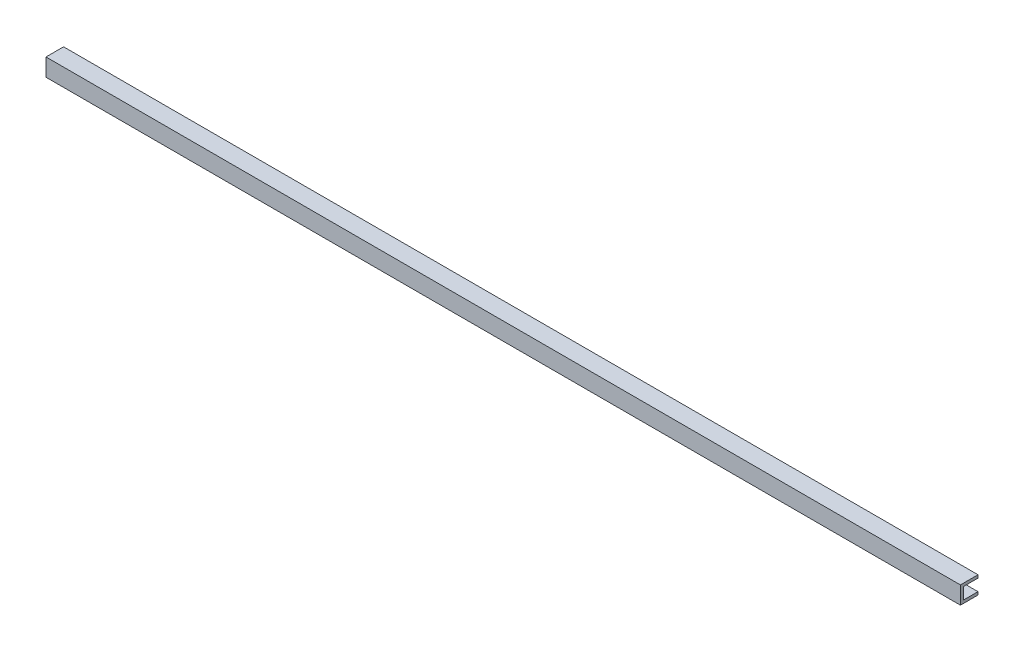
ISO-10303-21;
HEADER;
FILE_DESCRIPTION(('STEP AP214'),'2;1');
FILE_NAME('part.step','',(''),(''),'','','');
FILE_SCHEMA(('AUTOMOTIVE_DESIGN { 1 0 10303 214 1 1 1 1 }'));
ENDSEC;
DATA;
#1=APPLICATION_CONTEXT('core data for automotive mechanical design processes');
#2=APPLICATION_PROTOCOL_DEFINITION('international standard','automotive_design',2000,#1);
#3=PRODUCT_CONTEXT('',#1,'mechanical');
#4=PRODUCT('Part','Part','',(#3));
#5=PRODUCT_RELATED_PRODUCT_CATEGORY('part','',(#4));
#6=PRODUCT_DEFINITION_FORMATION('','',#4);
#7=PRODUCT_DEFINITION_CONTEXT('part definition',#1,'design');
#8=PRODUCT_DEFINITION('design','',#6,#7);
#9=PRODUCT_DEFINITION_SHAPE('','',#8);
#10=(LENGTH_UNIT() NAMED_UNIT(*) SI_UNIT(.MILLI.,.METRE.));
#11=(NAMED_UNIT(*) PLANE_ANGLE_UNIT() SI_UNIT($,.RADIAN.));
#12=(NAMED_UNIT(*) SI_UNIT($,.STERADIAN.) SOLID_ANGLE_UNIT());
#13=UNCERTAINTY_MEASURE_WITH_UNIT(LENGTH_MEASURE(1.E-05),#10,'distance_accuracy_value','');
#14=(GEOMETRIC_REPRESENTATION_CONTEXT(3) GLOBAL_UNCERTAINTY_ASSIGNED_CONTEXT((#13)) GLOBAL_UNIT_ASSIGNED_CONTEXT((#10,
#11,#12)) REPRESENTATION_CONTEXT('',''));
#15=CARTESIAN_POINT('',(0.,0.,0.));
#16=DIRECTION('',(0.,0.,1.));
#17=DIRECTION('',(1.,0.,0.));
#18=AXIS2_PLACEMENT_3D('',#15,#16,#17);
#19=CARTESIAN_POINT('',(-495.3,-9.525,0.));
#20=DIRECTION('',(0.,-1.,0.));
#21=DIRECTION('',(0.,0.,-1.));
#22=AXIS2_PLACEMENT_3D('',#19,#20,#21);
#23=PLANE('',#22);
#24=DIRECTION('',(1.,0.,0.));
#25=VECTOR('',#24,1.);
#26=CARTESIAN_POINT('',(-495.3,-9.525,0.));
#27=LINE('',#26,#25);
#28=CARTESIAN_POINT('',(-495.3,-9.525,0.));
#29=VERTEX_POINT('',#28);
#30=CARTESIAN_POINT('',(495.3,-9.525,0.));
#31=VERTEX_POINT('',#30);
#32=EDGE_CURVE('E84',#29,#31,#27,.T.);
#33=ORIENTED_EDGE('',*,*,#32,.F.);
#34=DIRECTION('',(0.,0.,-1.));
#35=VECTOR('',#34,1.);
#36=CARTESIAN_POINT('',(-495.3,-9.525,0.));
#37=LINE('',#36,#35);
#38=CARTESIAN_POINT('',(-495.3,-9.525,-19.05));
#39=VERTEX_POINT('',#38);
#40=EDGE_CURVE('E123',#29,#39,#37,.T.);
#41=ORIENTED_EDGE('',*,*,#40,.T.);
#42=DIRECTION('',(-1.,0.,0.));
#43=VECTOR('',#42,1.);
#44=CARTESIAN_POINT('',(-495.3,-9.525,-19.05));
#45=LINE('',#44,#43);
#46=CARTESIAN_POINT('',(495.3,-9.525,-19.05));
#47=VERTEX_POINT('',#46);
#48=EDGE_CURVE('E20',#47,#39,#45,.T.);
#49=ORIENTED_EDGE('',*,*,#48,.F.);
#50=DIRECTION('',(0.,0.,-1.));
#51=VECTOR('',#50,1.);
#52=CARTESIAN_POINT('',(495.3,-9.525,0.));
#53=LINE('',#52,#51);
#54=EDGE_CURVE('E95',#31,#47,#53,.T.);
#55=ORIENTED_EDGE('',*,*,#54,.F.);
#56=EDGE_LOOP('',(#33,#41,#49,#55));
#57=FACE_BOUND('',#56,.T.);
#58=ADVANCED_FACE('F17',(#57),#23,.T.);
#59=CARTESIAN_POINT('',(-495.3,-9.525,-19.05));
#60=DIRECTION('',(0.,0.,-1.));
#61=DIRECTION('',(-1.,0.,0.));
#62=AXIS2_PLACEMENT_3D('',#59,#60,#61);
#63=PLANE('',#62);
#64=ORIENTED_EDGE('',*,*,#48,.T.);
#65=DIRECTION('',(0.,1.,0.));
#66=VECTOR('',#65,1.);
#67=CARTESIAN_POINT('',(-495.3,0.,-19.05));
#68=LINE('',#67,#66);
#69=CARTESIAN_POINT('',(-495.3,-6.35,-19.05));
#70=VERTEX_POINT('',#69);
#71=EDGE_CURVE('E119',#39,#70,#68,.T.);
#72=ORIENTED_EDGE('',*,*,#71,.T.);
#73=DIRECTION('',(1.,0.,0.));
#74=VECTOR('',#73,1.);
#75=CARTESIAN_POINT('',(-495.3,-6.35,-19.05));
#76=LINE('',#75,#74);
#77=CARTESIAN_POINT('',(495.3,-6.35,-19.05));
#78=VERTEX_POINT('',#77);
#79=EDGE_CURVE('E111',#78,#70,#76,.F.);
#80=ORIENTED_EDGE('',*,*,#79,.F.);
#81=DIRECTION('',(0.,1.,0.));
#82=VECTOR('',#81,1.);
#83=CARTESIAN_POINT('',(495.3,0.,-19.05));
#84=LINE('',#83,#82);
#85=EDGE_CURVE('E98',#47,#78,#84,.T.);
#86=ORIENTED_EDGE('',*,*,#85,.F.);
#87=EDGE_LOOP('',(#64,#72,#80,#86));
#88=FACE_BOUND('',#87,.T.);
#89=ADVANCED_FACE('F118',(#88),#63,.T.);
#90=CARTESIAN_POINT('',(-495.3,-6.35,-19.05));
#91=DIRECTION('',(0.,1.,0.));
#92=DIRECTION('',(0.,0.,1.));
#93=AXIS2_PLACEMENT_3D('',#90,#91,#92);
#94=PLANE('',#93);
#95=ORIENTED_EDGE('',*,*,#79,.T.);
#96=DIRECTION('',(0.,0.,-1.));
#97=VECTOR('',#96,1.);
#98=CARTESIAN_POINT('',(-495.3,-6.35,0.));
#99=LINE('',#98,#97);
#100=CARTESIAN_POINT('',(-495.3,-6.35,-3.175));
#101=VERTEX_POINT('',#100);
#102=EDGE_CURVE('E125',#70,#101,#99,.F.);
#103=ORIENTED_EDGE('',*,*,#102,.T.);
#104=DIRECTION('',(-1.,0.,0.));
#105=VECTOR('',#104,1.);
#106=CARTESIAN_POINT('',(-495.3,-6.35,-3.175));
#107=LINE('',#106,#105);
#108=CARTESIAN_POINT('',(495.3,-6.35,-3.175));
#109=VERTEX_POINT('',#108);
#110=EDGE_CURVE('E109',#109,#101,#107,.T.);
#111=ORIENTED_EDGE('',*,*,#110,.F.);
#112=DIRECTION('',(0.,0.,-1.));
#113=VECTOR('',#112,1.);
#114=CARTESIAN_POINT('',(495.3,-6.35,0.));
#115=LINE('',#114,#113);
#116=EDGE_CURVE('E143',#78,#109,#115,.F.);
#117=ORIENTED_EDGE('',*,*,#116,.F.);
#118=EDGE_LOOP('',(#95,#103,#111,#117));
#119=FACE_BOUND('',#118,.T.);
#120=ADVANCED_FACE('F146',(#119),#94,.T.);
#121=CARTESIAN_POINT('',(-495.3,-6.35,-3.175));
#122=DIRECTION('',(0.,0.,-1.));
#123=DIRECTION('',(-1.,0.,0.));
#124=AXIS2_PLACEMENT_3D('',#121,#122,#123);
#125=PLANE('',#124);
#126=ORIENTED_EDGE('',*,*,#110,.T.);
#127=DIRECTION('',(0.,1.,0.));
#128=VECTOR('',#127,1.);
#129=CARTESIAN_POINT('',(-495.3,0.,-3.175));
#130=LINE('',#129,#128);
#131=CARTESIAN_POINT('',(-495.3,6.35,-3.175));
#132=VERTEX_POINT('',#131);
#133=EDGE_CURVE('E127',#101,#132,#130,.T.);
#134=ORIENTED_EDGE('',*,*,#133,.T.);
#135=DIRECTION('',(1.,0.,0.));
#136=VECTOR('',#135,1.);
#137=CARTESIAN_POINT('',(-495.3,6.35,-3.175));
#138=LINE('',#137,#136);
#139=CARTESIAN_POINT('',(495.3,6.35,-3.175));
#140=VERTEX_POINT('',#139);
#141=EDGE_CURVE('E92',#140,#132,#138,.F.);
#142=ORIENTED_EDGE('',*,*,#141,.F.);
#143=DIRECTION('',(0.,1.,0.));
#144=VECTOR('',#143,1.);
#145=CARTESIAN_POINT('',(495.3,0.,-3.175));
#146=LINE('',#145,#144);
#147=EDGE_CURVE('E140',#109,#140,#146,.T.);
#148=ORIENTED_EDGE('',*,*,#147,.F.);
#149=EDGE_LOOP('',(#126,#134,#142,#148));
#150=FACE_BOUND('',#149,.T.);
#151=ADVANCED_FACE('F148',(#150),#125,.T.);
#152=CARTESIAN_POINT('',(-495.3,6.35,-3.175));
#153=DIRECTION('',(0.,-1.,0.));
#154=DIRECTION('',(0.,0.,-1.));
#155=AXIS2_PLACEMENT_3D('',#152,#153,#154);
#156=PLANE('',#155);
#157=ORIENTED_EDGE('',*,*,#141,.T.);
#158=DIRECTION('',(0.,0.,-1.));
#159=VECTOR('',#158,1.);
#160=CARTESIAN_POINT('',(-495.3,6.35,0.));
#161=LINE('',#160,#159);
#162=CARTESIAN_POINT('',(-495.3,6.35,-19.05));
#163=VERTEX_POINT('',#162);
#164=EDGE_CURVE('E163',#132,#163,#161,.T.);
#165=ORIENTED_EDGE('',*,*,#164,.T.);
#166=DIRECTION('',(-1.,0.,0.));
#167=VECTOR('',#166,1.);
#168=CARTESIAN_POINT('',(-495.3,6.35,-19.05));
#169=LINE('',#168,#167);
#170=CARTESIAN_POINT('',(495.3,6.35,-19.05));
#171=VERTEX_POINT('',#170);
#172=EDGE_CURVE('E133',#171,#163,#169,.T.);
#173=ORIENTED_EDGE('',*,*,#172,.F.);
#174=DIRECTION('',(0.,0.,-1.));
#175=VECTOR('',#174,1.);
#176=CARTESIAN_POINT('',(495.3,6.35,0.));
#177=LINE('',#176,#175);
#178=EDGE_CURVE('E138',#140,#171,#177,.T.);
#179=ORIENTED_EDGE('',*,*,#178,.F.);
#180=EDGE_LOOP('',(#157,#165,#173,#179));
#181=FACE_BOUND('',#180,.T.);
#182=ADVANCED_FACE('F152',(#181),#156,.T.);
#183=CARTESIAN_POINT('',(-495.3,9.525,0.));
#184=DIRECTION('',(0.,0.,1.));
#185=DIRECTION('',(1.,0.,0.));
#186=AXIS2_PLACEMENT_3D('',#183,#184,#185);
#187=PLANE('',#186);
#188=DIRECTION('',(1.,0.,0.));
#189=VECTOR('',#188,1.);
#190=CARTESIAN_POINT('',(-495.3,9.525,0.));
#191=LINE('',#190,#189);
#192=CARTESIAN_POINT('',(-495.3,9.525,0.));
#193=VERTEX_POINT('',#192);
#194=CARTESIAN_POINT('',(495.3,9.525,0.));
#195=VERTEX_POINT('',#194);
#196=EDGE_CURVE('E158',#193,#195,#191,.T.);
#197=ORIENTED_EDGE('',*,*,#196,.F.);
#198=DIRECTION('',(0.,1.,0.));
#199=VECTOR('',#198,1.);
#200=CARTESIAN_POINT('',(-495.3,0.,0.));
#201=LINE('',#200,#199);
#202=EDGE_CURVE('E90',#193,#29,#201,.F.);
#203=ORIENTED_EDGE('',*,*,#202,.T.);
#204=ORIENTED_EDGE('',*,*,#32,.T.);
#205=DIRECTION('',(0.,1.,0.));
#206=VECTOR('',#205,1.);
#207=CARTESIAN_POINT('',(495.3,0.,0.));
#208=LINE('',#207,#206);
#209=EDGE_CURVE('E87',#195,#31,#208,.F.);
#210=ORIENTED_EDGE('',*,*,#209,.F.);
#211=EDGE_LOOP('',(#197,#203,#204,#210));
#212=FACE_BOUND('',#211,.T.);
#213=ADVANCED_FACE('F85',(#212),#187,.T.);
#214=CARTESIAN_POINT('',(495.3,0.,0.));
#215=DIRECTION('',(1.,0.,0.));
#216=DIRECTION('',(0.,0.,-1.));
#217=AXIS2_PLACEMENT_3D('',#214,#215,#216);
#218=PLANE('',#217);
#219=DIRECTION('',(0.,1.,0.));
#220=VECTOR('',#219,1.);
#221=CARTESIAN_POINT('',(495.3,6.35,-19.05));
#222=LINE('',#221,#220);
#223=CARTESIAN_POINT('',(495.3,9.525,-19.05));
#224=VERTEX_POINT('',#223);
#225=EDGE_CURVE('E135',#224,#171,#222,.F.);
#226=ORIENTED_EDGE('',*,*,#225,.F.);
#227=DIRECTION('',(0.,0.,1.));
#228=VECTOR('',#227,1.);
#229=CARTESIAN_POINT('',(495.3,9.525,-19.05));
#230=LINE('',#229,#228);
#231=EDGE_CURVE('E102',#195,#224,#230,.F.);
#232=ORIENTED_EDGE('',*,*,#231,.F.);
#233=ORIENTED_EDGE('',*,*,#209,.T.);
#234=ORIENTED_EDGE('',*,*,#54,.T.);
#235=ORIENTED_EDGE('',*,*,#85,.T.);
#236=ORIENTED_EDGE('',*,*,#116,.T.);
#237=ORIENTED_EDGE('',*,*,#147,.T.);
#238=ORIENTED_EDGE('',*,*,#178,.T.);
#239=EDGE_LOOP('',(#226,#232,#233,#234,#235,#236,#237,#238));
#240=FACE_BOUND('',#239,.T.);
#241=ADVANCED_FACE('F100',(#240),#218,.T.);
#242=CARTESIAN_POINT('',(-495.3,6.35,-19.05));
#243=DIRECTION('',(0.,0.,-1.));
#244=DIRECTION('',(-1.,0.,0.));
#245=AXIS2_PLACEMENT_3D('',#242,#243,#244);
#246=PLANE('',#245);
#247=ORIENTED_EDGE('',*,*,#172,.T.);
#248=DIRECTION('',(0.,1.,0.));
#249=VECTOR('',#248,1.);
#250=CARTESIAN_POINT('',(-495.3,0.,-19.05));
#251=LINE('',#250,#249);
#252=CARTESIAN_POINT('',(-495.3,9.525,-19.05));
#253=VERTEX_POINT('',#252);
#254=EDGE_CURVE('E35',#163,#253,#251,.T.);
#255=ORIENTED_EDGE('',*,*,#254,.T.);
#256=DIRECTION('',(1.,0.,0.));
#257=VECTOR('',#256,1.);
#258=CARTESIAN_POINT('',(-495.3,9.525,-19.05));
#259=LINE('',#258,#257);
#260=EDGE_CURVE('E26',#224,#253,#259,.F.);
#261=ORIENTED_EDGE('',*,*,#260,.F.);
#262=ORIENTED_EDGE('',*,*,#225,.T.);
#263=EDGE_LOOP('',(#247,#255,#261,#262));
#264=FACE_BOUND('',#263,.T.);
#265=ADVANCED_FACE('F154',(#264),#246,.T.);
#266=CARTESIAN_POINT('',(-495.3,0.,0.));
#267=DIRECTION('',(1.,0.,0.));
#268=DIRECTION('',(0.,0.,-1.));
#269=AXIS2_PLACEMENT_3D('',#266,#267,#268);
#270=PLANE('',#269);
#271=ORIENTED_EDGE('',*,*,#164,.F.);
#272=ORIENTED_EDGE('',*,*,#133,.F.);
#273=ORIENTED_EDGE('',*,*,#102,.F.);
#274=ORIENTED_EDGE('',*,*,#71,.F.);
#275=ORIENTED_EDGE('',*,*,#40,.F.);
#276=ORIENTED_EDGE('',*,*,#202,.F.);
#277=DIRECTION('',(0.,0.,1.));
#278=VECTOR('',#277,1.);
#279=CARTESIAN_POINT('',(-495.3,9.525,-19.05));
#280=LINE('',#279,#278);
#281=EDGE_CURVE('E11',#253,#193,#280,.T.);
#282=ORIENTED_EDGE('',*,*,#281,.F.);
#283=ORIENTED_EDGE('',*,*,#254,.F.);
#284=EDGE_LOOP('',(#271,#272,#273,#274,#275,#276,#282,#283));
#285=FACE_BOUND('',#284,.T.);
#286=ADVANCED_FACE('F122',(#285),#270,.F.);
#287=CARTESIAN_POINT('',(-495.3,9.525,-19.05));
#288=DIRECTION('',(0.,1.,0.));
#289=DIRECTION('',(0.,0.,1.));
#290=AXIS2_PLACEMENT_3D('',#287,#288,#289);
#291=PLANE('',#290);
#292=ORIENTED_EDGE('',*,*,#260,.T.);
#293=ORIENTED_EDGE('',*,*,#281,.T.);
#294=ORIENTED_EDGE('',*,*,#196,.T.);
#295=ORIENTED_EDGE('',*,*,#231,.T.);
#296=EDGE_LOOP('',(#292,#293,#294,#295));
#297=FACE_BOUND('',#296,.T.);
#298=ADVANCED_FACE('F157',(#297),#291,.T.);
#299=CLOSED_SHELL('',(#58,#89,#120,#151,#182,#213,#241,#265,#286,#298));
#300=MANIFOLD_SOLID_BREP('B1',#299);
#301=ADVANCED_BREP_SHAPE_REPRESENTATION('',(#18,#300),#14);
#302=SHAPE_DEFINITION_REPRESENTATION(#9,#301);
ENDSEC;
END-ISO-10303-21;
